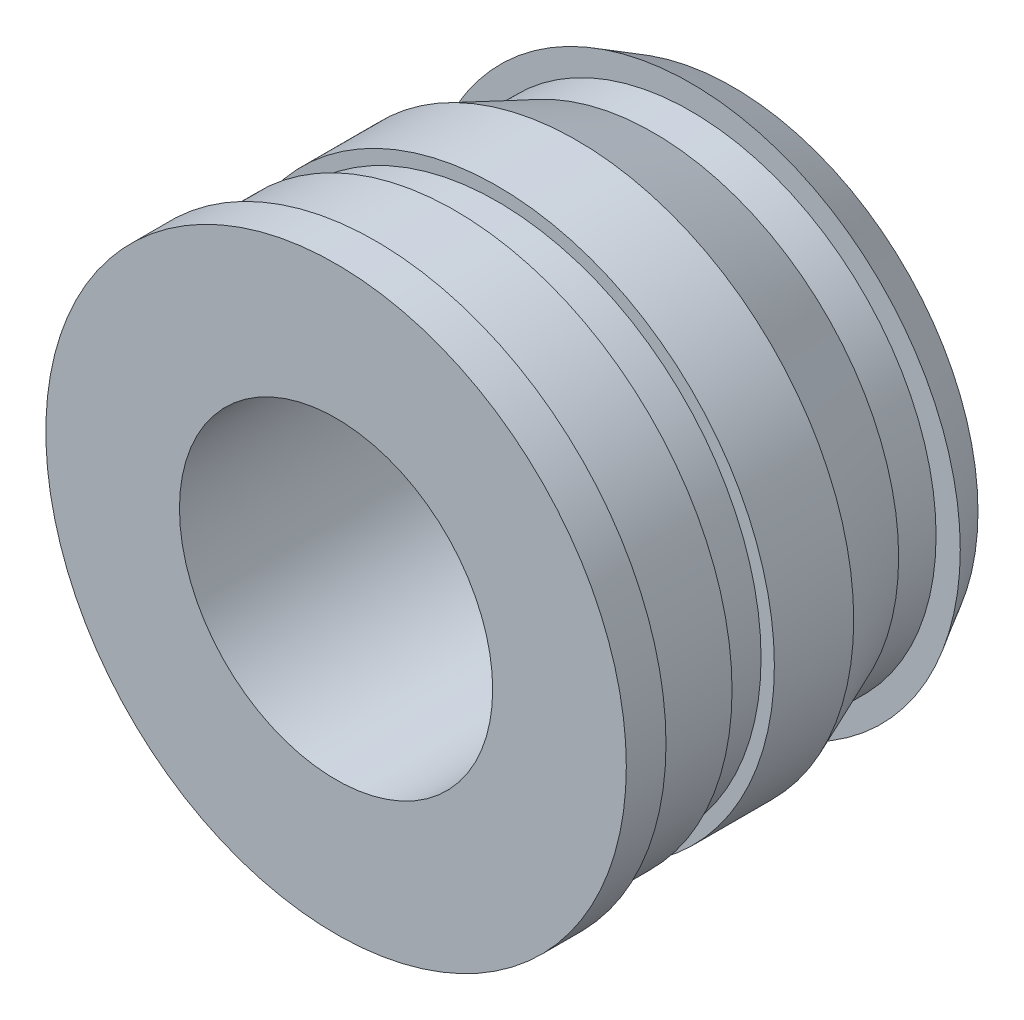
ISO-10303-21;
HEADER;
FILE_DESCRIPTION(('STEP AP214'),'2;1');
FILE_NAME('part.step','',(''),(''),'','','');
FILE_SCHEMA(('AUTOMOTIVE_DESIGN { 1 0 10303 214 1 1 1 1 }'));
ENDSEC;
DATA;
#1=APPLICATION_CONTEXT('core data for automotive mechanical design processes');
#2=APPLICATION_PROTOCOL_DEFINITION('international standard','automotive_design',2000,#1);
#3=PRODUCT_CONTEXT('',#1,'mechanical');
#4=PRODUCT('Part','Part','',(#3));
#5=PRODUCT_RELATED_PRODUCT_CATEGORY('part','',(#4));
#6=PRODUCT_DEFINITION_FORMATION('','',#4);
#7=PRODUCT_DEFINITION_CONTEXT('part definition',#1,'design');
#8=PRODUCT_DEFINITION('design','',#6,#7);
#9=PRODUCT_DEFINITION_SHAPE('','',#8);
#10=(LENGTH_UNIT() NAMED_UNIT(*) SI_UNIT(.MILLI.,.METRE.));
#11=(NAMED_UNIT(*) PLANE_ANGLE_UNIT() SI_UNIT($,.RADIAN.));
#12=(NAMED_UNIT(*) SI_UNIT($,.STERADIAN.) SOLID_ANGLE_UNIT());
#13=UNCERTAINTY_MEASURE_WITH_UNIT(LENGTH_MEASURE(1.E-05),#10,'distance_accuracy_value','');
#14=(GEOMETRIC_REPRESENTATION_CONTEXT(3) GLOBAL_UNCERTAINTY_ASSIGNED_CONTEXT((#13)) GLOBAL_UNIT_ASSIGNED_CONTEXT((#10,
#11,#12)) REPRESENTATION_CONTEXT('',''));
#15=CARTESIAN_POINT('',(0.,0.,0.));
#16=DIRECTION('',(0.,0.,1.));
#17=DIRECTION('',(1.,0.,0.));
#18=AXIS2_PLACEMENT_3D('',#15,#16,#17);
#19=CARTESIAN_POINT('',(0.,0.,1.9));
#20=DIRECTION('',(0.,0.,1.));
#21=DIRECTION('',(1.,0.,0.));
#22=AXIS2_PLACEMENT_3D('',#19,#20,#21);
#23=CYLINDRICAL_SURFACE('',#22,1.5);
#24=CARTESIAN_POINT('',(0.,0.,-1.9));
#25=DIRECTION('',(0.,0.,1.));
#26=DIRECTION('',(1.,0.,0.));
#27=AXIS2_PLACEMENT_3D('',#24,#25,#26);
#28=CIRCLE('',#27,1.5);
#29=CARTESIAN_POINT('',(1.5,0.,-1.9));
#30=VERTEX_POINT('',#29);
#31=EDGE_CURVE('E98',#30,#30,#28,.T.);
#32=ORIENTED_EDGE('',*,*,#31,.F.);
#33=EDGE_LOOP('',(#32));
#34=FACE_BOUND('',#33,.T.);
#35=CARTESIAN_POINT('',(0.,0.,1.9));
#36=DIRECTION('',(0.,0.,1.));
#37=DIRECTION('',(1.,0.,0.));
#38=AXIS2_PLACEMENT_3D('',#35,#36,#37);
#39=CIRCLE('',#38,1.5);
#40=CARTESIAN_POINT('',(1.5,0.,1.9));
#41=VERTEX_POINT('',#40);
#42=EDGE_CURVE('E10',#41,#41,#39,.T.);
#43=ORIENTED_EDGE('',*,*,#42,.T.);
#44=EDGE_LOOP('',(#43));
#45=FACE_BOUND('',#44,.T.);
#46=ADVANCED_FACE('F39',(#34,#45),#23,.F.);
#47=CARTESIAN_POINT('',(0.,1.5,1.9));
#48=DIRECTION('',(0.,0.,-1.));
#49=DIRECTION('',(-1.,0.,0.));
#50=AXIS2_PLACEMENT_3D('',#47,#48,#49);
#51=PLANE('',#50);
#52=ORIENTED_EDGE('',*,*,#42,.F.);
#53=EDGE_LOOP('',(#52));
#54=FACE_BOUND('',#53,.T.);
#55=CARTESIAN_POINT('',(0.,0.,1.9));
#56=DIRECTION('',(0.,0.,1.));
#57=DIRECTION('',(1.,0.,0.));
#58=AXIS2_PLACEMENT_3D('',#55,#56,#57);
#59=CIRCLE('',#58,2.78);
#60=CARTESIAN_POINT('',(2.78,0.,1.9));
#61=VERTEX_POINT('',#60);
#62=EDGE_CURVE('E46',#61,#61,#59,.T.);
#63=ORIENTED_EDGE('',*,*,#62,.T.);
#64=EDGE_LOOP('',(#63));
#65=FACE_BOUND('',#64,.T.);
#66=ADVANCED_FACE('F106',(#54,#65),#51,.F.);
#67=CARTESIAN_POINT('',(0.,0.,1.9));
#68=DIRECTION('',(0.,0.,1.));
#69=DIRECTION('',(1.,0.,0.));
#70=AXIS2_PLACEMENT_3D('',#67,#68,#69);
#71=CYLINDRICAL_SURFACE('',#70,2.78);
#72=ORIENTED_EDGE('',*,*,#62,.F.);
#73=EDGE_LOOP('',(#72));
#74=FACE_BOUND('',#73,.T.);
#75=CARTESIAN_POINT('',(0.,0.,1.52));
#76=DIRECTION('',(0.,0.,1.));
#77=DIRECTION('',(1.,0.,0.));
#78=AXIS2_PLACEMENT_3D('',#75,#76,#77);
#79=CIRCLE('',#78,2.78);
#80=CARTESIAN_POINT('',(2.78,0.,1.52));
#81=VERTEX_POINT('',#80);
#82=EDGE_CURVE('E51',#81,#81,#79,.T.);
#83=ORIENTED_EDGE('',*,*,#82,.T.);
#84=EDGE_LOOP('',(#83));
#85=FACE_BOUND('',#84,.T.);
#86=ADVANCED_FACE('F110',(#74,#85),#71,.T.);
#87=CARTESIAN_POINT('',(0.,2.78,1.52));
#88=DIRECTION('',(0.,0.,1.));
#89=DIRECTION('',(1.,0.,0.));
#90=AXIS2_PLACEMENT_3D('',#87,#88,#89);
#91=PLANE('',#90);
#92=ORIENTED_EDGE('',*,*,#82,.F.);
#93=EDGE_LOOP('',(#92));
#94=FACE_BOUND('',#93,.T.);
#95=CARTESIAN_POINT('',(0.,0.,1.52));
#96=DIRECTION('',(0.,0.,1.));
#97=DIRECTION('',(1.,0.,0.));
#98=AXIS2_PLACEMENT_3D('',#95,#96,#97);
#99=CIRCLE('',#98,2.6525);
#100=CARTESIAN_POINT('',(2.6525,0.,1.52));
#101=VERTEX_POINT('',#100);
#102=EDGE_CURVE('E56',#101,#101,#99,.T.);
#103=ORIENTED_EDGE('',*,*,#102,.T.);
#104=EDGE_LOOP('',(#103));
#105=FACE_BOUND('',#104,.T.);
#106=ADVANCED_FACE('F115',(#94,#105),#91,.F.);
#107=CARTESIAN_POINT('',(0.,0.,1.9));
#108=DIRECTION('',(0.,0.,1.));
#109=DIRECTION('',(1.,0.,0.));
#110=AXIS2_PLACEMENT_3D('',#107,#108,#109);
#111=CYLINDRICAL_SURFACE('',#110,2.6525);
#112=ORIENTED_EDGE('',*,*,#102,.F.);
#113=EDGE_LOOP('',(#112));
#114=FACE_BOUND('',#113,.T.);
#115=CARTESIAN_POINT('',(0.,0.,0.76));
#116=DIRECTION('',(0.,0.,1.));
#117=DIRECTION('',(1.,0.,0.));
#118=AXIS2_PLACEMENT_3D('',#115,#116,#117);
#119=CIRCLE('',#118,2.6525);
#120=CARTESIAN_POINT('',(2.6525,0.,0.76));
#121=VERTEX_POINT('',#120);
#122=EDGE_CURVE('E62',#121,#121,#119,.T.);
#123=ORIENTED_EDGE('',*,*,#122,.T.);
#124=EDGE_LOOP('',(#123));
#125=FACE_BOUND('',#124,.T.);
#126=ADVANCED_FACE('F121',(#114,#125),#111,.T.);
#127=CARTESIAN_POINT('',(0.,2.6525,0.76));
#128=DIRECTION('',(0.,0.,1.));
#129=DIRECTION('',(1.,0.,0.));
#130=AXIS2_PLACEMENT_3D('',#127,#128,#129);
#131=PLANE('',#130);
#132=ORIENTED_EDGE('',*,*,#122,.F.);
#133=EDGE_LOOP('',(#132));
#134=FACE_BOUND('',#133,.T.);
#135=CARTESIAN_POINT('',(0.,0.,0.76));
#136=DIRECTION('',(0.,0.,1.));
#137=DIRECTION('',(1.,0.,0.));
#138=AXIS2_PLACEMENT_3D('',#135,#136,#137);
#139=CIRCLE('',#138,2.525);
#140=CARTESIAN_POINT('',(2.525,0.,0.76));
#141=VERTEX_POINT('',#140);
#142=EDGE_CURVE('E66',#141,#141,#139,.T.);
#143=ORIENTED_EDGE('',*,*,#142,.T.);
#144=EDGE_LOOP('',(#143));
#145=FACE_BOUND('',#144,.T.);
#146=ADVANCED_FACE('F125',(#134,#145),#131,.F.);
#147=CARTESIAN_POINT('',(0.,0.,1.9));
#148=DIRECTION('',(0.,0.,1.));
#149=DIRECTION('',(1.,0.,0.));
#150=AXIS2_PLACEMENT_3D('',#147,#148,#149);
#151=CYLINDRICAL_SURFACE('',#150,2.525);
#152=ORIENTED_EDGE('',*,*,#142,.F.);
#153=EDGE_LOOP('',(#152));
#154=FACE_BOUND('',#153,.T.);
#155=CARTESIAN_POINT('',(0.,0.,0.354524476352013));
#156=DIRECTION('',(0.,0.,1.));
#157=DIRECTION('',(1.,0.,0.));
#158=AXIS2_PLACEMENT_3D('',#155,#156,#157);
#159=CIRCLE('',#158,2.525);
#160=CARTESIAN_POINT('',(2.525,0.,0.354524476352013));
#161=VERTEX_POINT('',#160);
#162=EDGE_CURVE('E70',#161,#161,#159,.T.);
#163=ORIENTED_EDGE('',*,*,#162,.T.);
#164=EDGE_LOOP('',(#163));
#165=FACE_BOUND('',#164,.T.);
#166=ADVANCED_FACE('F129',(#154,#165),#151,.T.);
#167=CARTESIAN_POINT('',(0.,2.525,0.354524476352013));
#168=DIRECTION('',(0.,0.,-1.));
#169=DIRECTION('',(-1.,0.,0.));
#170=AXIS2_PLACEMENT_3D('',#167,#168,#169);
#171=PLANE('',#170);
#172=ORIENTED_EDGE('',*,*,#162,.F.);
#173=EDGE_LOOP('',(#172));
#174=FACE_BOUND('',#173,.T.);
#175=CARTESIAN_POINT('',(0.,0.,0.354524476352013));
#176=DIRECTION('',(0.,0.,1.));
#177=DIRECTION('',(1.,0.,0.));
#178=AXIS2_PLACEMENT_3D('',#175,#176,#177);
#179=CIRCLE('',#178,2.6525);
#180=CARTESIAN_POINT('',(2.6525,0.,0.354524476352013));
#181=VERTEX_POINT('',#180);
#182=EDGE_CURVE('E74',#181,#181,#179,.T.);
#183=ORIENTED_EDGE('',*,*,#182,.T.);
#184=EDGE_LOOP('',(#183));
#185=FACE_BOUND('',#184,.T.);
#186=ADVANCED_FACE('F133',(#174,#185),#171,.F.);
#187=CARTESIAN_POINT('',(0.,0.,1.9));
#188=DIRECTION('',(0.,0.,1.));
#189=DIRECTION('',(1.,0.,0.));
#190=AXIS2_PLACEMENT_3D('',#187,#188,#189);
#191=CYLINDRICAL_SURFACE('',#190,2.6525);
#192=ORIENTED_EDGE('',*,*,#182,.F.);
#193=EDGE_LOOP('',(#192));
#194=FACE_BOUND('',#193,.T.);
#195=CARTESIAN_POINT('',(0.,0.,-0.405475523647987));
#196=DIRECTION('',(0.,0.,1.));
#197=DIRECTION('',(1.,0.,0.));
#198=AXIS2_PLACEMENT_3D('',#195,#196,#197);
#199=CIRCLE('',#198,2.6525);
#200=CARTESIAN_POINT('',(2.6525,0.,-0.405475523647987));
#201=VERTEX_POINT('',#200);
#202=EDGE_CURVE('E78',#201,#201,#199,.T.);
#203=ORIENTED_EDGE('',*,*,#202,.T.);
#204=EDGE_LOOP('',(#203));
#205=FACE_BOUND('',#204,.T.);
#206=ADVANCED_FACE('F137',(#194,#205),#191,.T.);
#207=CARTESIAN_POINT('',(0.,0.,-1.14));
#208=DIRECTION('',(0.,0.,1.));
#209=DIRECTION('',(1.,0.,0.));
#210=AXIS2_PLACEMENT_3D('',#207,#208,#209);
#211=CONICAL_SURFACE('',#210,2.34825,0.392699081698725);
#212=ORIENTED_EDGE('',*,*,#202,.F.);
#213=EDGE_LOOP('',(#212));
#214=FACE_BOUND('',#213,.T.);
#215=CARTESIAN_POINT('',(0.,0.,-1.14));
#216=DIRECTION('',(0.,0.,1.));
#217=DIRECTION('',(1.,0.,0.));
#218=AXIS2_PLACEMENT_3D('',#215,#216,#217);
#219=CIRCLE('',#218,2.34825);
#220=CARTESIAN_POINT('',(2.34825,0.,-1.14));
#221=VERTEX_POINT('',#220);
#222=EDGE_CURVE('E82',#221,#221,#219,.T.);
#223=ORIENTED_EDGE('',*,*,#222,.T.);
#224=EDGE_LOOP('',(#223));
#225=FACE_BOUND('',#224,.T.);
#226=ADVANCED_FACE('F141',(#214,#225),#211,.T.);
#227=CARTESIAN_POINT('',(0.,0.,1.9));
#228=DIRECTION('',(0.,0.,1.));
#229=DIRECTION('',(1.,0.,0.));
#230=AXIS2_PLACEMENT_3D('',#227,#228,#229);
#231=CYLINDRICAL_SURFACE('',#230,2.34825);
#232=ORIENTED_EDGE('',*,*,#222,.F.);
#233=EDGE_LOOP('',(#232));
#234=FACE_BOUND('',#233,.T.);
#235=CARTESIAN_POINT('',(0.,0.,-1.49859722534591));
#236=DIRECTION('',(0.,0.,1.));
#237=DIRECTION('',(1.,0.,0.));
#238=AXIS2_PLACEMENT_3D('',#235,#236,#237);
#239=CIRCLE('',#238,2.34825);
#240=CARTESIAN_POINT('',(2.34825,0.,-1.49859722534591));
#241=VERTEX_POINT('',#240);
#242=EDGE_CURVE('E86',#241,#241,#239,.T.);
#243=ORIENTED_EDGE('',*,*,#242,.T.);
#244=EDGE_LOOP('',(#243));
#245=FACE_BOUND('',#244,.T.);
#246=ADVANCED_FACE('F145',(#234,#245),#231,.T.);
#247=CARTESIAN_POINT('',(0.,2.34825,-1.49859722534591));
#248=DIRECTION('',(0.,0.,-1.));
#249=DIRECTION('',(-1.,0.,0.));
#250=AXIS2_PLACEMENT_3D('',#247,#248,#249);
#251=PLANE('',#250);
#252=ORIENTED_EDGE('',*,*,#242,.F.);
#253=EDGE_LOOP('',(#252));
#254=FACE_BOUND('',#253,.T.);
#255=CARTESIAN_POINT('',(0.,0.,-1.49859722534591));
#256=DIRECTION('',(0.,0.,1.));
#257=DIRECTION('',(1.,0.,0.));
#258=AXIS2_PLACEMENT_3D('',#255,#256,#257);
#259=CIRCLE('',#258,2.58);
#260=CARTESIAN_POINT('',(2.58,0.,-1.49859722534591));
#261=VERTEX_POINT('',#260);
#262=EDGE_CURVE('E90',#261,#261,#259,.T.);
#263=ORIENTED_EDGE('',*,*,#262,.T.);
#264=EDGE_LOOP('',(#263));
#265=FACE_BOUND('',#264,.T.);
#266=ADVANCED_FACE('F149',(#254,#265),#251,.F.);
#267=CARTESIAN_POINT('',(0.,0.,-1.9));
#268=DIRECTION('',(0.,0.,1.));
#269=DIRECTION('',(1.,0.,0.));
#270=AXIS2_PLACEMENT_3D('',#267,#268,#269);
#271=CONICAL_SURFACE('',#270,2.34825,0.523598775598301);
#272=ORIENTED_EDGE('',*,*,#262,.F.);
#273=EDGE_LOOP('',(#272));
#274=FACE_BOUND('',#273,.T.);
#275=CARTESIAN_POINT('',(0.,0.,-1.9));
#276=DIRECTION('',(0.,0.,1.));
#277=DIRECTION('',(1.,0.,0.));
#278=AXIS2_PLACEMENT_3D('',#275,#276,#277);
#279=CIRCLE('',#278,2.34825);
#280=CARTESIAN_POINT('',(2.34825,0.,-1.9));
#281=VERTEX_POINT('',#280);
#282=EDGE_CURVE('E94',#281,#281,#279,.T.);
#283=ORIENTED_EDGE('',*,*,#282,.T.);
#284=EDGE_LOOP('',(#283));
#285=FACE_BOUND('',#284,.T.);
#286=ADVANCED_FACE('F153',(#274,#285),#271,.T.);
#287=CARTESIAN_POINT('',(0.,2.34825,-1.9));
#288=DIRECTION('',(0.,0.,1.));
#289=DIRECTION('',(1.,0.,0.));
#290=AXIS2_PLACEMENT_3D('',#287,#288,#289);
#291=PLANE('',#290);
#292=ORIENTED_EDGE('',*,*,#282,.F.);
#293=EDGE_LOOP('',(#292));
#294=FACE_BOUND('',#293,.T.);
#295=ORIENTED_EDGE('',*,*,#31,.T.);
#296=EDGE_LOOP('',(#295));
#297=FACE_BOUND('',#296,.T.);
#298=ADVANCED_FACE('F103',(#294,#297),#291,.F.);
#299=CLOSED_SHELL('',(#46,#66,#86,#106,#126,#146,#166,#186,#206,#226,#246,#266,#286,#298));
#300=MANIFOLD_SOLID_BREP('B2',#299);
#301=ADVANCED_BREP_SHAPE_REPRESENTATION('',(#18,#300),#14);
#302=SHAPE_DEFINITION_REPRESENTATION(#9,#301);
ENDSEC;
END-ISO-10303-21;
